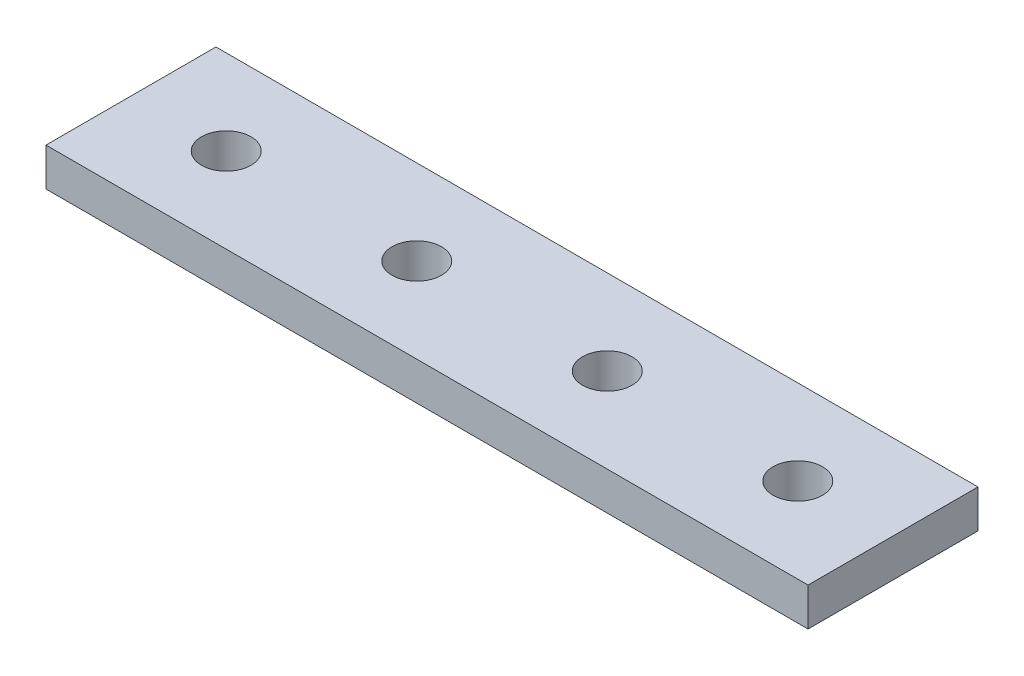
ISO-10303-21;
HEADER;
FILE_DESCRIPTION(('STEP AP214'),'2;1');
FILE_NAME('part.step','',(''),(''),'','','');
FILE_SCHEMA(('AUTOMOTIVE_DESIGN { 1 0 10303 214 1 1 1 1 }'));
ENDSEC;
DATA;
#1=APPLICATION_CONTEXT('core data for automotive mechanical design processes');
#2=APPLICATION_PROTOCOL_DEFINITION('international standard','automotive_design',2000,#1);
#3=PRODUCT_CONTEXT('',#1,'mechanical');
#4=PRODUCT('Part','Part','',(#3));
#5=PRODUCT_RELATED_PRODUCT_CATEGORY('part','',(#4));
#6=PRODUCT_DEFINITION_FORMATION('','',#4);
#7=PRODUCT_DEFINITION_CONTEXT('part definition',#1,'design');
#8=PRODUCT_DEFINITION('design','',#6,#7);
#9=PRODUCT_DEFINITION_SHAPE('','',#8);
#10=(LENGTH_UNIT() NAMED_UNIT(*) SI_UNIT(.MILLI.,.METRE.));
#11=(NAMED_UNIT(*) PLANE_ANGLE_UNIT() SI_UNIT($,.RADIAN.));
#12=(NAMED_UNIT(*) SI_UNIT($,.STERADIAN.) SOLID_ANGLE_UNIT());
#13=UNCERTAINTY_MEASURE_WITH_UNIT(LENGTH_MEASURE(1.E-05),#10,'distance_accuracy_value','');
#14=(GEOMETRIC_REPRESENTATION_CONTEXT(3) GLOBAL_UNCERTAINTY_ASSIGNED_CONTEXT((#13)) GLOBAL_UNIT_ASSIGNED_CONTEXT((#10,
#11,#12)) REPRESENTATION_CONTEXT('',''));
#15=CARTESIAN_POINT('',(0.,0.,0.));
#16=DIRECTION('',(0.,0.,1.));
#17=DIRECTION('',(1.,0.,0.));
#18=AXIS2_PLACEMENT_3D('',#15,#16,#17);
#19=CARTESIAN_POINT('',(50.,-5.,11.15));
#20=DIRECTION('',(1.,0.,0.));
#21=DIRECTION('',(0.,0.,-1.));
#22=AXIS2_PLACEMENT_3D('',#19,#20,#21);
#23=PLANE('',#22);
#24=DIRECTION('',(0.,0.,-1.));
#25=VECTOR('',#24,1.);
#26=CARTESIAN_POINT('',(50.,0.,11.15));
#27=LINE('',#26,#25);
#28=CARTESIAN_POINT('',(50.,0.,11.15));
#29=VERTEX_POINT('',#28);
#30=CARTESIAN_POINT('',(50.,0.,-11.15));
#31=VERTEX_POINT('',#30);
#32=EDGE_CURVE('E101',#29,#31,#27,.T.);
#33=ORIENTED_EDGE('',*,*,#32,.F.);
#34=DIRECTION('',(0.,1.,0.));
#35=VECTOR('',#34,1.);
#36=CARTESIAN_POINT('',(50.,-5.,11.15));
#37=LINE('',#36,#35);
#38=CARTESIAN_POINT('',(50.,-5.,11.15));
#39=VERTEX_POINT('',#38);
#40=EDGE_CURVE('E11',#39,#29,#37,.T.);
#41=ORIENTED_EDGE('',*,*,#40,.F.);
#42=DIRECTION('',(0.,0.,-1.));
#43=VECTOR('',#42,1.);
#44=CARTESIAN_POINT('',(50.,-5.,11.15));
#45=LINE('',#44,#43);
#46=CARTESIAN_POINT('',(50.,-5.,-11.15));
#47=VERTEX_POINT('',#46);
#48=EDGE_CURVE('E94',#39,#47,#45,.T.);
#49=ORIENTED_EDGE('',*,*,#48,.T.);
#50=DIRECTION('',(0.,1.,0.));
#51=VECTOR('',#50,1.);
#52=CARTESIAN_POINT('',(50.,-5.,-11.15));
#53=LINE('',#52,#51);
#54=EDGE_CURVE('E39',#47,#31,#53,.T.);
#55=ORIENTED_EDGE('',*,*,#54,.T.);
#56=EDGE_LOOP('',(#33,#41,#49,#55));
#57=FACE_BOUND('',#56,.T.);
#58=ADVANCED_FACE('F36',(#57),#23,.T.);
#59=CARTESIAN_POINT('',(-50.,-5.,11.15));
#60=DIRECTION('',(0.,0.,1.));
#61=DIRECTION('',(1.,0.,0.));
#62=AXIS2_PLACEMENT_3D('',#59,#60,#61);
#63=PLANE('',#62);
#64=DIRECTION('',(1.,0.,0.));
#65=VECTOR('',#64,1.);
#66=CARTESIAN_POINT('',(-50.,0.,11.15));
#67=LINE('',#66,#65);
#68=CARTESIAN_POINT('',(-50.,0.,11.15));
#69=VERTEX_POINT('',#68);
#70=EDGE_CURVE('E96',#69,#29,#67,.T.);
#71=ORIENTED_EDGE('',*,*,#70,.F.);
#72=DIRECTION('',(0.,1.,0.));
#73=VECTOR('',#72,1.);
#74=CARTESIAN_POINT('',(-50.,-5.,11.15));
#75=LINE('',#74,#73);
#76=CARTESIAN_POINT('',(-50.,-5.,11.15));
#77=VERTEX_POINT('',#76);
#78=EDGE_CURVE('E45',#77,#69,#75,.T.);
#79=ORIENTED_EDGE('',*,*,#78,.F.);
#80=DIRECTION('',(1.,0.,0.));
#81=VECTOR('',#80,1.);
#82=CARTESIAN_POINT('',(-50.,-5.,11.15));
#83=LINE('',#82,#81);
#84=EDGE_CURVE('E91',#77,#39,#83,.T.);
#85=ORIENTED_EDGE('',*,*,#84,.T.);
#86=ORIENTED_EDGE('',*,*,#40,.T.);
#87=EDGE_LOOP('',(#71,#79,#85,#86));
#88=FACE_BOUND('',#87,.T.);
#89=ADVANCED_FACE('F112',(#88),#63,.T.);
#90=CARTESIAN_POINT('',(-50.,-5.,11.15));
#91=DIRECTION('',(-1.,0.,0.));
#92=DIRECTION('',(0.,0.,1.));
#93=AXIS2_PLACEMENT_3D('',#90,#91,#92);
#94=PLANE('',#93);
#95=DIRECTION('',(0.,0.,1.));
#96=VECTOR('',#95,1.);
#97=CARTESIAN_POINT('',(-50.,0.,11.15));
#98=LINE('',#97,#96);
#99=CARTESIAN_POINT('',(-50.,0.,-11.15));
#100=VERTEX_POINT('',#99);
#101=EDGE_CURVE('E86',#100,#69,#98,.T.);
#102=ORIENTED_EDGE('',*,*,#101,.F.);
#103=DIRECTION('',(0.,1.,0.));
#104=VECTOR('',#103,1.);
#105=CARTESIAN_POINT('',(-50.,-5.,-11.15));
#106=LINE('',#105,#104);
#107=CARTESIAN_POINT('',(-50.,-5.,-11.15));
#108=VERTEX_POINT('',#107);
#109=EDGE_CURVE('E81',#108,#100,#106,.T.);
#110=ORIENTED_EDGE('',*,*,#109,.F.);
#111=DIRECTION('',(0.,0.,1.));
#112=VECTOR('',#111,1.);
#113=CARTESIAN_POINT('',(-50.,-5.,11.15));
#114=LINE('',#113,#112);
#115=EDGE_CURVE('E84',#108,#77,#114,.T.);
#116=ORIENTED_EDGE('',*,*,#115,.T.);
#117=ORIENTED_EDGE('',*,*,#78,.T.);
#118=EDGE_LOOP('',(#102,#110,#116,#117));
#119=FACE_BOUND('',#118,.T.);
#120=ADVANCED_FACE('F83',(#119),#94,.T.);
#121=CARTESIAN_POINT('',(-50.,-5.,-11.15));
#122=DIRECTION('',(0.,0.,-1.));
#123=DIRECTION('',(-1.,0.,0.));
#124=AXIS2_PLACEMENT_3D('',#121,#122,#123);
#125=PLANE('',#124);
#126=DIRECTION('',(-1.,0.,0.));
#127=VECTOR('',#126,1.);
#128=CARTESIAN_POINT('',(-50.,0.,-11.15));
#129=LINE('',#128,#127);
#130=EDGE_CURVE('E104',#31,#100,#129,.T.);
#131=ORIENTED_EDGE('',*,*,#130,.F.);
#132=ORIENTED_EDGE('',*,*,#54,.F.);
#133=DIRECTION('',(-1.,0.,0.));
#134=VECTOR('',#133,1.);
#135=CARTESIAN_POINT('',(-50.,-5.,-11.15));
#136=LINE('',#135,#134);
#137=EDGE_CURVE('E90',#47,#108,#136,.T.);
#138=ORIENTED_EDGE('',*,*,#137,.T.);
#139=ORIENTED_EDGE('',*,*,#109,.T.);
#140=EDGE_LOOP('',(#131,#132,#138,#139));
#141=FACE_BOUND('',#140,.T.);
#142=ADVANCED_FACE('F93',(#141),#125,.T.);
#143=CARTESIAN_POINT('',(0.,-5.,0.));
#144=DIRECTION('',(0.,-1.,0.));
#145=DIRECTION('',(0.,0.,-1.));
#146=AXIS2_PLACEMENT_3D('',#143,#144,#145);
#147=PLANE('',#146);
#148=CARTESIAN_POINT('',(37.5,-5.,0.));
#149=DIRECTION('',(0.,1.,0.));
#150=DIRECTION('',(0.,0.,1.));
#151=AXIS2_PLACEMENT_3D('',#148,#149,#150);
#152=CIRCLE('',#151,3.25);
#153=CARTESIAN_POINT('',(37.5,-5.,3.25));
#154=VERTEX_POINT('',#153);
#155=EDGE_CURVE('E153',#154,#154,#152,.T.);
#156=ORIENTED_EDGE('',*,*,#155,.T.);
#157=EDGE_LOOP('',(#156));
#158=FACE_BOUND('',#157,.T.);
#159=CARTESIAN_POINT('',(12.5,-5.,0.));
#160=DIRECTION('',(0.,1.,0.));
#161=DIRECTION('',(0.,0.,1.));
#162=AXIS2_PLACEMENT_3D('',#159,#160,#161);
#163=CIRCLE('',#162,3.25);
#164=CARTESIAN_POINT('',(12.5,-5.,3.25));
#165=VERTEX_POINT('',#164);
#166=EDGE_CURVE('E161',#165,#165,#163,.T.);
#167=ORIENTED_EDGE('',*,*,#166,.T.);
#168=EDGE_LOOP('',(#167));
#169=FACE_BOUND('',#168,.T.);
#170=CARTESIAN_POINT('',(-12.5,-5.,0.));
#171=DIRECTION('',(0.,1.,0.));
#172=DIRECTION('',(0.,0.,1.));
#173=AXIS2_PLACEMENT_3D('',#170,#171,#172);
#174=CIRCLE('',#173,3.25);
#175=CARTESIAN_POINT('',(-12.5,-5.,3.25));
#176=VERTEX_POINT('',#175);
#177=EDGE_CURVE('E167',#176,#176,#174,.T.);
#178=ORIENTED_EDGE('',*,*,#177,.T.);
#179=EDGE_LOOP('',(#178));
#180=FACE_BOUND('',#179,.T.);
#181=CARTESIAN_POINT('',(-37.5,-5.,0.));
#182=DIRECTION('',(0.,1.,0.));
#183=DIRECTION('',(0.,0.,1.));
#184=AXIS2_PLACEMENT_3D('',#181,#182,#183);
#185=CIRCLE('',#184,3.25);
#186=CARTESIAN_POINT('',(-37.5,-5.,3.25));
#187=VERTEX_POINT('',#186);
#188=EDGE_CURVE('E105',#187,#187,#185,.T.);
#189=ORIENTED_EDGE('',*,*,#188,.T.);
#190=EDGE_LOOP('',(#189));
#191=FACE_BOUND('',#190,.T.);
#192=ORIENTED_EDGE('',*,*,#48,.F.);
#193=ORIENTED_EDGE('',*,*,#84,.F.);
#194=ORIENTED_EDGE('',*,*,#115,.F.);
#195=ORIENTED_EDGE('',*,*,#137,.F.);
#196=EDGE_LOOP('',(#192,#193,#194,#195));
#197=FACE_BOUND('',#196,.T.);
#198=ADVANCED_FACE('F89',(#158,#169,#180,#191,#197),#147,.T.);
#199=CARTESIAN_POINT('',(0.,0.,0.));
#200=DIRECTION('',(0.,-1.,0.));
#201=DIRECTION('',(0.,0.,-1.));
#202=AXIS2_PLACEMENT_3D('',#199,#200,#201);
#203=PLANE('',#202);
#204=CARTESIAN_POINT('',(37.5,0.,0.));
#205=DIRECTION('',(0.,1.,0.));
#206=DIRECTION('',(0.,0.,1.));
#207=AXIS2_PLACEMENT_3D('',#204,#205,#206);
#208=CIRCLE('',#207,3.25);
#209=CARTESIAN_POINT('',(37.5,0.,3.25));
#210=VERTEX_POINT('',#209);
#211=EDGE_CURVE('E156',#210,#210,#208,.T.);
#212=ORIENTED_EDGE('',*,*,#211,.F.);
#213=EDGE_LOOP('',(#212));
#214=FACE_BOUND('',#213,.T.);
#215=CARTESIAN_POINT('',(12.5,0.,0.));
#216=DIRECTION('',(0.,1.,0.));
#217=DIRECTION('',(0.,0.,1.));
#218=AXIS2_PLACEMENT_3D('',#215,#216,#217);
#219=CIRCLE('',#218,3.25);
#220=CARTESIAN_POINT('',(12.5,0.,3.25));
#221=VERTEX_POINT('',#220);
#222=EDGE_CURVE('E158',#221,#221,#219,.T.);
#223=ORIENTED_EDGE('',*,*,#222,.F.);
#224=EDGE_LOOP('',(#223));
#225=FACE_BOUND('',#224,.T.);
#226=CARTESIAN_POINT('',(-12.5,0.,0.));
#227=DIRECTION('',(0.,1.,0.));
#228=DIRECTION('',(0.,0.,1.));
#229=AXIS2_PLACEMENT_3D('',#226,#227,#228);
#230=CIRCLE('',#229,3.25);
#231=CARTESIAN_POINT('',(-12.5,0.,3.25));
#232=VERTEX_POINT('',#231);
#233=EDGE_CURVE('E164',#232,#232,#230,.T.);
#234=ORIENTED_EDGE('',*,*,#233,.F.);
#235=EDGE_LOOP('',(#234));
#236=FACE_BOUND('',#235,.T.);
#237=CARTESIAN_POINT('',(-37.5,0.,0.));
#238=DIRECTION('',(0.,1.,0.));
#239=DIRECTION('',(0.,0.,1.));
#240=AXIS2_PLACEMENT_3D('',#237,#238,#239);
#241=CIRCLE('',#240,3.25);
#242=CARTESIAN_POINT('',(-37.5,0.,3.25));
#243=VERTEX_POINT('',#242);
#244=EDGE_CURVE('E170',#243,#243,#241,.T.);
#245=ORIENTED_EDGE('',*,*,#244,.F.);
#246=EDGE_LOOP('',(#245));
#247=FACE_BOUND('',#246,.T.);
#248=ORIENTED_EDGE('',*,*,#32,.T.);
#249=ORIENTED_EDGE('',*,*,#130,.T.);
#250=ORIENTED_EDGE('',*,*,#101,.T.);
#251=ORIENTED_EDGE('',*,*,#70,.T.);
#252=EDGE_LOOP('',(#248,#249,#250,#251));
#253=FACE_BOUND('',#252,.T.);
#254=ADVANCED_FACE('F111',(#214,#225,#236,#247,#253),#203,.F.);
#255=CARTESIAN_POINT('',(-37.5,-5.,0.));
#256=DIRECTION('',(0.,1.,0.));
#257=DIRECTION('',(0.,0.,1.));
#258=AXIS2_PLACEMENT_3D('',#255,#256,#257);
#259=CYLINDRICAL_SURFACE('',#258,3.25);
#260=ORIENTED_EDGE('',*,*,#188,.F.);
#261=EDGE_LOOP('',(#260));
#262=FACE_BOUND('',#261,.T.);
#263=ORIENTED_EDGE('',*,*,#244,.T.);
#264=EDGE_LOOP('',(#263));
#265=FACE_BOUND('',#264,.T.);
#266=ADVANCED_FACE('F130',(#262,#265),#259,.F.);
#267=CARTESIAN_POINT('',(-12.5,-5.,0.));
#268=DIRECTION('',(0.,1.,0.));
#269=DIRECTION('',(0.,0.,1.));
#270=AXIS2_PLACEMENT_3D('',#267,#268,#269);
#271=CYLINDRICAL_SURFACE('',#270,3.25);
#272=ORIENTED_EDGE('',*,*,#177,.F.);
#273=EDGE_LOOP('',(#272));
#274=FACE_BOUND('',#273,.T.);
#275=ORIENTED_EDGE('',*,*,#233,.T.);
#276=EDGE_LOOP('',(#275));
#277=FACE_BOUND('',#276,.T.);
#278=ADVANCED_FACE('F137',(#274,#277),#271,.F.);
#279=CARTESIAN_POINT('',(12.5,-5.,0.));
#280=DIRECTION('',(0.,1.,0.));
#281=DIRECTION('',(0.,0.,1.));
#282=AXIS2_PLACEMENT_3D('',#279,#280,#281);
#283=CYLINDRICAL_SURFACE('',#282,3.25);
#284=ORIENTED_EDGE('',*,*,#166,.F.);
#285=EDGE_LOOP('',(#284));
#286=FACE_BOUND('',#285,.T.);
#287=ORIENTED_EDGE('',*,*,#222,.T.);
#288=EDGE_LOOP('',(#287));
#289=FACE_BOUND('',#288,.T.);
#290=ADVANCED_FACE('F141',(#286,#289),#283,.F.);
#291=CARTESIAN_POINT('',(37.5,-5.,0.));
#292=DIRECTION('',(0.,1.,0.));
#293=DIRECTION('',(0.,0.,1.));
#294=AXIS2_PLACEMENT_3D('',#291,#292,#293);
#295=CYLINDRICAL_SURFACE('',#294,3.25);
#296=ORIENTED_EDGE('',*,*,#155,.F.);
#297=EDGE_LOOP('',(#296));
#298=FACE_BOUND('',#297,.T.);
#299=ORIENTED_EDGE('',*,*,#211,.T.);
#300=EDGE_LOOP('',(#299));
#301=FACE_BOUND('',#300,.T.);
#302=ADVANCED_FACE('F145',(#298,#301),#295,.F.);
#303=CLOSED_SHELL('',(#58,#89,#120,#142,#198,#254,#266,#278,#290,#302));
#304=MANIFOLD_SOLID_BREP('B2',#303);
#305=ADVANCED_BREP_SHAPE_REPRESENTATION('',(#18,#304),#14);
#306=SHAPE_DEFINITION_REPRESENTATION(#9,#305);
ENDSEC;
END-ISO-10303-21;
